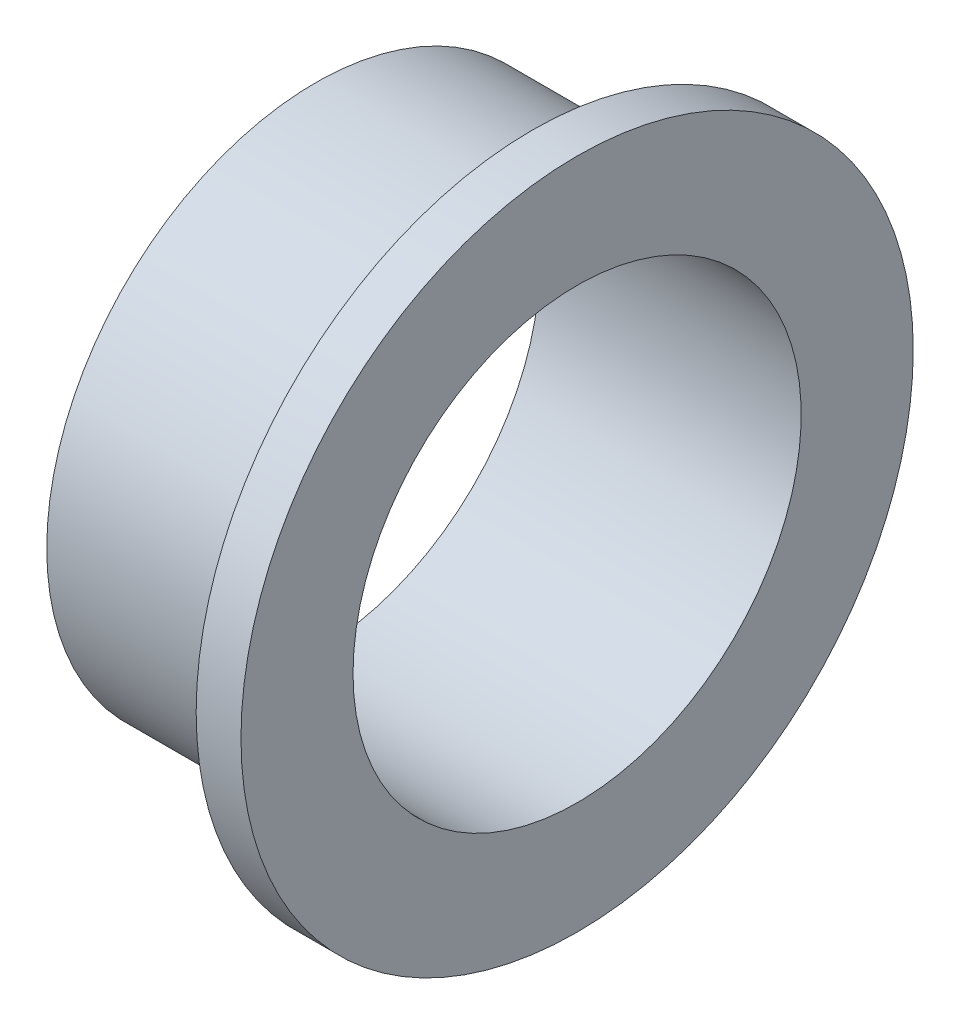
ISO-10303-21;
HEADER;
FILE_DESCRIPTION(('STEP AP214'),'2;1');
FILE_NAME('part.step','',(''),(''),'','','');
FILE_SCHEMA(('AUTOMOTIVE_DESIGN { 1 0 10303 214 1 1 1 1 }'));
ENDSEC;
DATA;
#1=APPLICATION_CONTEXT('core data for automotive mechanical design processes');
#2=APPLICATION_PROTOCOL_DEFINITION('international standard','automotive_design',2000,#1);
#3=PRODUCT_CONTEXT('',#1,'mechanical');
#4=PRODUCT('Part','Part','',(#3));
#5=PRODUCT_RELATED_PRODUCT_CATEGORY('part','',(#4));
#6=PRODUCT_DEFINITION_FORMATION('','',#4);
#7=PRODUCT_DEFINITION_CONTEXT('part definition',#1,'design');
#8=PRODUCT_DEFINITION('design','',#6,#7);
#9=PRODUCT_DEFINITION_SHAPE('','',#8);
#10=(LENGTH_UNIT() NAMED_UNIT(*) SI_UNIT(.MILLI.,.METRE.));
#11=(NAMED_UNIT(*) PLANE_ANGLE_UNIT() SI_UNIT($,.RADIAN.));
#12=(NAMED_UNIT(*) SI_UNIT($,.STERADIAN.) SOLID_ANGLE_UNIT());
#13=UNCERTAINTY_MEASURE_WITH_UNIT(LENGTH_MEASURE(1.E-05),#10,'distance_accuracy_value','');
#14=(GEOMETRIC_REPRESENTATION_CONTEXT(3) GLOBAL_UNCERTAINTY_ASSIGNED_CONTEXT((#13)) GLOBAL_UNIT_ASSIGNED_CONTEXT((#10,
#11,#12)) REPRESENTATION_CONTEXT('',''));
#15=CARTESIAN_POINT('',(0.,0.,0.));
#16=DIRECTION('',(0.,0.,1.));
#17=DIRECTION('',(1.,0.,0.));
#18=AXIS2_PLACEMENT_3D('',#15,#16,#17);
#19=CARTESIAN_POINT('',(-35.,36.,0.));
#20=DIRECTION('',(1.,0.,0.));
#21=DIRECTION('',(0.,0.,-1.));
#22=AXIS2_PLACEMENT_3D('',#19,#20,#21);
#23=PLANE('',#22);
#24=CARTESIAN_POINT('',(-35.,0.,0.));
#25=DIRECTION('',(-1.,0.,0.));
#26=DIRECTION('',(0.,0.,1.));
#27=AXIS2_PLACEMENT_3D('',#24,#25,#26);
#28=CIRCLE('',#27,30.);
#29=CARTESIAN_POINT('',(-35.,0.,30.));
#30=VERTEX_POINT('',#29);
#31=EDGE_CURVE('E10',#30,#30,#28,.T.);
#32=ORIENTED_EDGE('',*,*,#31,.F.);
#33=EDGE_LOOP('',(#32));
#34=FACE_BOUND('',#33,.T.);
#35=CARTESIAN_POINT('',(-35.,0.,0.));
#36=DIRECTION('',(-1.,0.,0.));
#37=DIRECTION('',(0.,0.,1.));
#38=AXIS2_PLACEMENT_3D('',#35,#36,#37);
#39=CIRCLE('',#38,36.);
#40=CARTESIAN_POINT('',(-35.,0.,36.));
#41=VERTEX_POINT('',#40);
#42=EDGE_CURVE('E55',#41,#41,#39,.T.);
#43=ORIENTED_EDGE('',*,*,#42,.T.);
#44=EDGE_LOOP('',(#43));
#45=FACE_BOUND('',#44,.T.);
#46=ADVANCED_FACE('F33',(#34,#45),#23,.F.);
#47=CARTESIAN_POINT('',(-57.1232876712329,0.,0.));
#48=DIRECTION('',(-1.,0.,0.));
#49=DIRECTION('',(0.,0.,1.));
#50=AXIS2_PLACEMENT_3D('',#47,#48,#49);
#51=CYLINDRICAL_SURFACE('',#50,30.);
#52=CARTESIAN_POINT('',(0.,0.,0.));
#53=DIRECTION('',(-1.,0.,0.));
#54=DIRECTION('',(0.,0.,1.));
#55=AXIS2_PLACEMENT_3D('',#52,#53,#54);
#56=CIRCLE('',#55,30.);
#57=CARTESIAN_POINT('',(0.,0.,30.));
#58=VERTEX_POINT('',#57);
#59=EDGE_CURVE('E39',#58,#58,#56,.T.);
#60=ORIENTED_EDGE('',*,*,#59,.F.);
#61=EDGE_LOOP('',(#60));
#62=FACE_BOUND('',#61,.T.);
#63=ORIENTED_EDGE('',*,*,#31,.T.);
#64=EDGE_LOOP('',(#63));
#65=FACE_BOUND('',#64,.T.);
#66=ADVANCED_FACE('F80',(#62,#65),#51,.F.);
#67=CARTESIAN_POINT('',(0.,30.,0.));
#68=DIRECTION('',(-1.,0.,0.));
#69=DIRECTION('',(0.,0.,1.));
#70=AXIS2_PLACEMENT_3D('',#67,#68,#69);
#71=PLANE('',#70);
#72=CARTESIAN_POINT('',(0.,0.,0.));
#73=DIRECTION('',(-1.,0.,0.));
#74=DIRECTION('',(0.,0.,1.));
#75=AXIS2_PLACEMENT_3D('',#72,#73,#74);
#76=CIRCLE('',#75,45.);
#77=CARTESIAN_POINT('',(0.,0.,45.));
#78=VERTEX_POINT('',#77);
#79=EDGE_CURVE('E43',#78,#78,#76,.T.);
#80=ORIENTED_EDGE('',*,*,#79,.F.);
#81=EDGE_LOOP('',(#80));
#82=FACE_BOUND('',#81,.T.);
#83=ORIENTED_EDGE('',*,*,#59,.T.);
#84=EDGE_LOOP('',(#83));
#85=FACE_BOUND('',#84,.T.);
#86=ADVANCED_FACE('F75',(#82,#85),#71,.F.);
#87=CARTESIAN_POINT('',(-57.1232876712329,0.,0.));
#88=DIRECTION('',(-1.,0.,0.));
#89=DIRECTION('',(0.,0.,1.));
#90=AXIS2_PLACEMENT_3D('',#87,#88,#89);
#91=CYLINDRICAL_SURFACE('',#90,45.);
#92=CARTESIAN_POINT('',(-6.,0.,0.));
#93=DIRECTION('',(-1.,0.,0.));
#94=DIRECTION('',(0.,0.,1.));
#95=AXIS2_PLACEMENT_3D('',#92,#93,#94);
#96=CIRCLE('',#95,45.);
#97=CARTESIAN_POINT('',(-6.,0.,45.));
#98=VERTEX_POINT('',#97);
#99=EDGE_CURVE('E47',#98,#98,#96,.T.);
#100=ORIENTED_EDGE('',*,*,#99,.F.);
#101=EDGE_LOOP('',(#100));
#102=FACE_BOUND('',#101,.T.);
#103=ORIENTED_EDGE('',*,*,#79,.T.);
#104=EDGE_LOOP('',(#103));
#105=FACE_BOUND('',#104,.T.);
#106=ADVANCED_FACE('F69',(#102,#105),#91,.T.);
#107=CARTESIAN_POINT('',(-6.,36.,0.));
#108=DIRECTION('',(1.,0.,0.));
#109=DIRECTION('',(0.,0.,-1.));
#110=AXIS2_PLACEMENT_3D('',#107,#108,#109);
#111=PLANE('',#110);
#112=CARTESIAN_POINT('',(-6.,0.,0.));
#113=DIRECTION('',(-1.,0.,0.));
#114=DIRECTION('',(0.,0.,1.));
#115=AXIS2_PLACEMENT_3D('',#112,#113,#114);
#116=CIRCLE('',#115,36.);
#117=CARTESIAN_POINT('',(-6.,0.,36.));
#118=VERTEX_POINT('',#117);
#119=EDGE_CURVE('E52',#118,#118,#116,.T.);
#120=ORIENTED_EDGE('',*,*,#119,.F.);
#121=EDGE_LOOP('',(#120));
#122=FACE_BOUND('',#121,.T.);
#123=ORIENTED_EDGE('',*,*,#99,.T.);
#124=EDGE_LOOP('',(#123));
#125=FACE_BOUND('',#124,.T.);
#126=ADVANCED_FACE('F63',(#122,#125),#111,.F.);
#127=CARTESIAN_POINT('',(-57.1232876712329,0.,0.));
#128=DIRECTION('',(-1.,0.,0.));
#129=DIRECTION('',(0.,0.,1.));
#130=AXIS2_PLACEMENT_3D('',#127,#128,#129);
#131=CYLINDRICAL_SURFACE('',#130,36.);
#132=ORIENTED_EDGE('',*,*,#42,.F.);
#133=EDGE_LOOP('',(#132));
#134=FACE_BOUND('',#133,.T.);
#135=ORIENTED_EDGE('',*,*,#119,.T.);
#136=EDGE_LOOP('',(#135));
#137=FACE_BOUND('',#136,.T.);
#138=ADVANCED_FACE('F60',(#134,#137),#131,.T.);
#139=CLOSED_SHELL('',(#46,#66,#86,#106,#126,#138));
#140=MANIFOLD_SOLID_BREP('B2',#139);
#141=ADVANCED_BREP_SHAPE_REPRESENTATION('',(#18,#140),#14);
#142=SHAPE_DEFINITION_REPRESENTATION(#9,#141);
ENDSEC;
END-ISO-10303-21;
